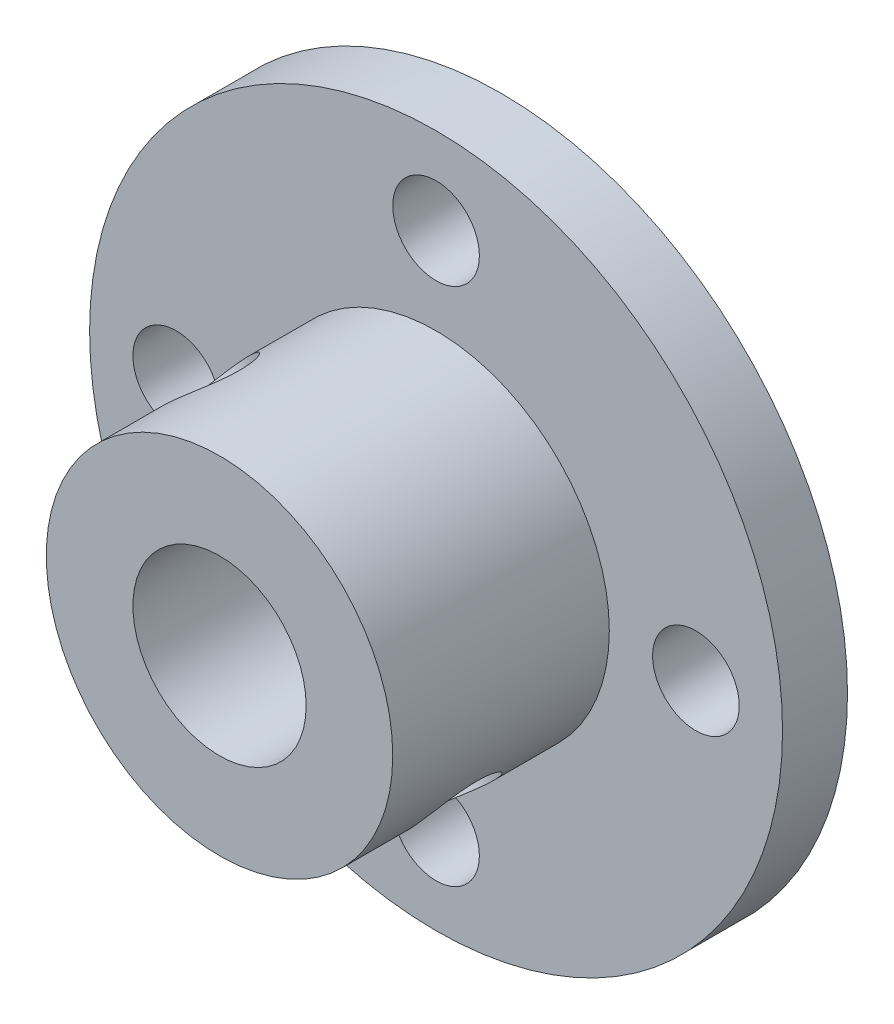
ISO-10303-21;
HEADER;
FILE_DESCRIPTION(('STEP AP214'),'2;1');
FILE_NAME('part.step','',(''),(''),'','','');
FILE_SCHEMA(('AUTOMOTIVE_DESIGN { 1 0 10303 214 1 1 1 1 }'));
ENDSEC;
DATA;
#1=APPLICATION_CONTEXT('core data for automotive mechanical design processes');
#2=APPLICATION_PROTOCOL_DEFINITION('international standard','automotive_design',2000,#1);
#3=PRODUCT_CONTEXT('',#1,'mechanical');
#4=PRODUCT('Part','Part','',(#3));
#5=PRODUCT_RELATED_PRODUCT_CATEGORY('part','',(#4));
#6=PRODUCT_DEFINITION_FORMATION('','',#4);
#7=PRODUCT_DEFINITION_CONTEXT('part definition',#1,'design');
#8=PRODUCT_DEFINITION('design','',#6,#7);
#9=PRODUCT_DEFINITION_SHAPE('','',#8);
#10=(LENGTH_UNIT() NAMED_UNIT(*) SI_UNIT(.MILLI.,.METRE.));
#11=(NAMED_UNIT(*) PLANE_ANGLE_UNIT() SI_UNIT($,.RADIAN.));
#12=(NAMED_UNIT(*) SI_UNIT($,.STERADIAN.) SOLID_ANGLE_UNIT());
#13=UNCERTAINTY_MEASURE_WITH_UNIT(LENGTH_MEASURE(1.E-05),#10,'distance_accuracy_value','');
#14=(GEOMETRIC_REPRESENTATION_CONTEXT(3) GLOBAL_UNCERTAINTY_ASSIGNED_CONTEXT((#13)) GLOBAL_UNIT_ASSIGNED_CONTEXT((#10,
#11,#12)) REPRESENTATION_CONTEXT('',''));
#15=CARTESIAN_POINT('',(0.,0.,0.));
#16=DIRECTION('',(0.,0.,1.));
#17=DIRECTION('',(1.,0.,0.));
#18=AXIS2_PLACEMENT_3D('',#15,#16,#17);
#19=CARTESIAN_POINT('',(-16.0009999999999,16.0010000000001,8.));
#20=DIRECTION('',(0.707106781186544,-0.707106781186551,0.));
#21=DIRECTION('',(0.707106781186551,0.707106781186544,0.));
#22=AXIS2_PLACEMENT_3D('',#19,#20,#21);
#23=CYLINDRICAL_SURFACE('',#22,2.);
#24=CARTESIAN_POINT('',(-1.03527618041007,3.86370330515628,8.));
#25=CARTESIAN_POINT('',(-1.03528937115707,3.86370459881445,8.10421320547435));
#26=CARTESIAN_POINT('',(-1.04445095043976,3.86128100934838,8.2085621765338));
#27=CARTESIAN_POINT('',(-1.08031794598722,3.8513940803619,8.4140551772306));
#28=CARTESIAN_POINT('',(-1.10706022667328,3.84392015002067,8.51519200324776));
#29=CARTESIAN_POINT('',(-1.1757681040263,3.82345847525807,8.71090315644694));
#30=CARTESIAN_POINT('',(-1.21765273191301,3.81049999591904,8.80550925884925));
#31=CARTESIAN_POINT('',(-1.31402940114759,3.77834613351914,8.98684845047615));
#32=CARTESIAN_POINT('',(-1.36852212452516,3.75915041303458,9.07358111343678));
#33=CARTESIAN_POINT('',(-1.49242262258693,3.71179474047927,9.24461144313339));
#34=CARTESIAN_POINT('',(-1.56268986729788,3.68302601797016,9.32811826759177));
#35=CARTESIAN_POINT('',(-1.71185746004074,3.61610679381541,9.4828167805706));
#36=CARTESIAN_POINT('',(-1.79076208249941,3.57795163529629,9.55400232620397));
#37=CARTESIAN_POINT('',(-1.95971138096947,3.48844672204307,9.6867343011885));
#38=CARTESIAN_POINT('',(-2.0501484554851,3.43638092272624,9.74730753542331));
#39=CARTESIAN_POINT('',(-2.23353894528089,3.32009909967183,9.85028170678709));
#40=CARTESIAN_POINT('',(-2.32649073298613,3.25589078089576,9.8926941123508));
#41=CARTESIAN_POINT('',(-2.50423233896789,3.12095657273505,9.95500932253118));
#42=CARTESIAN_POINT('',(-2.58913230708545,3.05101952081115,9.9762990526921));
#43=CARTESIAN_POINT('',(-2.75418828042582,2.90288047261231,10.000332237369));
#44=CARTESIAN_POINT('',(-2.83434712692782,2.82468350628805,10.0030869135963));
#45=CARTESIAN_POINT('',(-2.98040182849613,2.66974853723374,9.99050665205486));
#46=CARTESIAN_POINT('',(-3.04693182899991,2.59347500057567,9.97672396895637));
#47=CARTESIAN_POINT('',(-3.1721605338748,2.43871042756158,9.93423831219188));
#48=CARTESIAN_POINT('',(-3.23085865182078,2.36021922568683,9.90553422204788));
#49=CARTESIAN_POINT('',(-3.34040810707924,2.20250531142359,9.83383486782005));
#50=CARTESIAN_POINT('',(-3.39113964482628,2.12328750299558,9.79064737365578));
#51=CARTESIAN_POINT('',(-3.48370759115981,1.96773626752488,9.6914731675971));
#52=CARTESIAN_POINT('',(-3.52554080478517,1.89140388456177,9.63548187339533));
#53=CARTESIAN_POINT('',(-3.60428958213897,1.73703649261153,9.50620929693394));
#54=CARTESIAN_POINT('',(-3.64036649555481,1.65952260135774,9.43179394334797));
#55=CARTESIAN_POINT('',(-3.70332720013195,1.51382940179716,9.27082055013965));
#56=CARTESIAN_POINT('',(-3.73020393016801,1.44565728724412,9.18425325545188));
#57=CARTESIAN_POINT('',(-3.77728932408924,1.31795685047572,8.99470361515182));
#58=CARTESIAN_POINT('',(-3.79696615323055,1.25925236275471,8.89102795389158));
#59=CARTESIAN_POINT('',(-3.82838022178833,1.16027085528415,8.674124657282));
#60=CARTESIAN_POINT('',(-3.84012575033585,1.11997461107768,8.56090713396488));
#61=CARTESIAN_POINT('',(-3.85603227368293,1.06386498780706,8.33757097743442));
#62=CARTESIAN_POINT('',(-3.8607205491991,1.04636450399109,8.2279177619129));
#63=CARTESIAN_POINT('',(-3.86461594335437,1.03189824566565,8.00719731696691));
#64=CARTESIAN_POINT('',(-3.86382693378152,1.03491796578463,7.8961311417604));
#65=CARTESIAN_POINT('',(-3.85709694959109,1.0596805772454,7.68869216284256));
#66=CARTESIAN_POINT('',(-3.85172899517204,1.07933918703679,7.59204109778422));
#67=CARTESIAN_POINT('',(-3.83624732829455,1.13313003382101,7.40326442745801));
#68=CARTESIAN_POINT('',(-3.8261320788553,1.16726695795747,7.31114029850652));
#69=CARTESIAN_POINT('',(-3.80000571468504,1.24976121811307,7.12917733819489));
#70=CARTESIAN_POINT('',(-3.7837432298891,1.29870394849985,7.03964196629395));
#71=CARTESIAN_POINT('',(-3.74462291896735,1.40753017427797,6.86906145692096));
#72=CARTESIAN_POINT('',(-3.72176170262139,1.46741928775997,6.78802071296949));
#73=CARTESIAN_POINT('',(-3.66524154585662,1.60377873262911,6.62604246495734));
#74=CARTESIAN_POINT('',(-3.63058476054876,1.681387579446,6.54640569858222));
#75=CARTESIAN_POINT('',(-3.55073224013689,1.84404659815513,6.40117552399527));
#76=CARTESIAN_POINT('',(-3.50553295582569,1.92909927002596,6.33558685947316));
#77=CARTESIAN_POINT('',(-3.40252567713479,2.10559182003167,6.21885254816729));
#78=CARTESIAN_POINT('',(-3.34441639819569,2.19714102664405,6.16813376383323));
#79=CARTESIAN_POINT('',(-3.21642497959978,2.38056150742934,6.08572419203039));
#80=CARTESIAN_POINT('',(-3.14655324686926,2.47243242721348,6.0540166963159));
#81=CARTESIAN_POINT('',(-3.0033013691683,2.64414859154454,6.01326287251486));
#82=CARTESIAN_POINT('',(-2.93083135085753,2.72432380326585,6.00240425133573));
#83=CARTESIAN_POINT('',(-2.77934729282197,2.87869858365824,5.99831346600433));
#84=CARTESIAN_POINT('',(-2.70033555329971,2.95290023480645,6.00507513147114));
#85=CARTESIAN_POINT('',(-2.54388975347635,3.08846943561532,6.03483282431641));
#86=CARTESIAN_POINT('',(-2.46669480823199,3.15036049200077,6.05672973730905));
#87=CARTESIAN_POINT('',(-2.31149669440087,3.26593797100565,6.11465395980667));
#88=CARTESIAN_POINT('',(-2.23349341147185,3.31962321548964,6.15068329570691));
#89=CARTESIAN_POINT('',(-2.07583342321289,3.42053391102494,6.23745425499141));
#90=CARTESIAN_POINT('',(-1.99624869216628,3.46738486763521,6.28875921975186));
#91=CARTESIAN_POINT('',(-1.84145699969247,3.55201788731207,6.4039152881181));
#92=CARTESIAN_POINT('',(-1.76625206959519,3.58979576730869,6.46777215410157));
#93=CARTESIAN_POINT('',(-1.61555786947551,3.66026791477987,6.61359663555942));
#94=CARTESIAN_POINT('',(-1.5407851518637,3.692082097764,6.69673418080029));
#95=CARTESIAN_POINT('',(-1.40285481283076,3.74666670664265,6.87489222830609));
#96=CARTESIAN_POINT('',(-1.33970747877437,3.76942914306031,6.96992313136052));
#97=CARTESIAN_POINT('',(-1.22691845246328,3.80767032151754,7.17330889413025));
#98=CARTESIAN_POINT('',(-1.17776662816841,3.82289615256723,7.28198991073528));
#99=CARTESIAN_POINT('',(-1.1193520755234,3.84024140403409,7.45057811963095));
#100=CARTESIAN_POINT('',(-1.10244115407726,3.84510564702045,7.50764782059068));
#101=CARTESIAN_POINT('',(-1.07408098437127,3.8531247587118,7.62323255750019));
#102=CARTESIAN_POINT('',(-1.06262791767174,3.85628082270829,7.68174655275425));
#103=CARTESIAN_POINT('',(-1.04783389616823,3.86032188599498,7.78360078924729));
#104=CARTESIAN_POINT('',(-1.04313310007069,3.86159132004936,7.82673305725008));
#105=CARTESIAN_POINT('',(-1.03685139155018,3.86328178867123,7.9132356930929));
#106=CARTESIAN_POINT('',(-1.03527068784066,3.86370276648267,7.9566060766667));
#107=CARTESIAN_POINT('',(-1.03527618041007,3.86370330515628,8.));
#108=B_SPLINE_CURVE_WITH_KNOTS('',3,(#24,#25,#26,#27,#28,#29,#30,#31,#32,#33,#34,#35,#36,#37,
#38,#39,#40,#41,#42,#43,#44,#45,#46,#47,#48,#49,#50,#51,#52,#53,#54,#55,#56,#57,#58,#59,#60,#61,
#62,#63,#64,#65,#66,#67,#68,#69,#70,#71,#72,#73,#74,#75,#76,#77,#78,#79,#80,#81,#82,#83,#84,#85,
#86,#87,#88,#89,#90,#91,#92,#93,#94,#95,#96,#97,#98,#99,#100,#101,#102,#103,#104,#105,#106,
#107),.UNSPECIFIED.,.T.,.F.,(4,2,2,2,2,2,2,2,2,2,2,2,2,2,2,2,2,2,2,2,2,2,2,2,2,2,2,2,2,2,2,2,2,
2,2,2,2,2,2,2,2,4),(0.,0.312464245189432,0.62558578564961,0.937057191861536,1.24854545093096,
1.58572462503713,1.92307142172808,2.28315784481594,2.64301653931849,2.97726969939937,
3.31132047376147,3.61632194973143,3.92134625038977,4.2305906946636,4.5399459870461,
4.87854382917848,5.21740096495904,5.57777683462964,5.93777548427477,6.2692458171249,
6.60048186380813,6.89548366852118,7.19058104876193,7.49934592816242,7.80826972444162,
8.15613487165293,8.50411729960471,8.86128362829998,9.2181355962161,9.5422454078304,
9.8662417359201,10.1688884974705,10.4715786702809,10.7872150144301,11.1029966020551,
11.450204837042,11.7977188569438,12.1562149808128,12.3351395323571,12.5139387197526,
12.6440387634036,12.7741475095882),.UNSPECIFIED.);
#109=CARTESIAN_POINT('',(-1.03527618041007,3.86370330515628,8.));
#110=VERTEX_POINT('',#109);
#111=EDGE_CURVE('E42',#110,#110,#108,.T.);
#112=ORIENTED_EDGE('',*,*,#111,.T.);
#113=EDGE_LOOP('',(#112));
#114=FACE_BOUND('',#113,.T.);
#115=CARTESIAN_POINT('',(-4.06301201267853,6.89143913742478,8.));
#116=CARTESIAN_POINT('',(-4.06301572174605,6.89143840992681,7.88955939925874));
#117=CARTESIAN_POINT('',(-4.07119094661862,6.88663699998201,7.77908408105719));
#118=CARTESIAN_POINT('',(-4.10347952386447,6.86744467364213,7.56130593746119));
#119=CARTESIAN_POINT('',(-4.12760215209937,6.85304817619187,7.45400499642545));
#120=CARTESIAN_POINT('',(-4.19053882294763,6.81474355280742,7.24575716945026));
#121=CARTESIAN_POINT('',(-4.22933389862519,6.79084770456589,7.14480227569144));
#122=CARTESIAN_POINT('',(-4.3198345608916,6.73363818775691,6.9517513179681));
#123=CARTESIAN_POINT('',(-4.37154069559709,6.70032411934728,6.85965563033583));
#124=CARTESIAN_POINT('',(-4.48684637018169,6.62367602880001,6.68491068379023));
#125=CARTESIAN_POINT('',(-4.55066154225097,6.58015630647199,6.60248511971996));
#126=CARTESIAN_POINT('',(-4.68695643232213,6.48377932397727,6.45139088451173));
#127=CARTESIAN_POINT('',(-4.7594369593601,6.43092119171464,6.3827234995026));
#128=CARTESIAN_POINT('',(-4.91142734598455,6.31562284697672,6.26017962589498));
#129=CARTESIAN_POINT('',(-4.99102117674818,6.25305922347525,6.20652288947083));
#130=CARTESIAN_POINT('',(-5.15341964034347,6.11990810519381,6.11695228467754));
#131=CARTESIAN_POINT('',(-5.23622379749711,6.04932179617393,6.08103579846759));
#132=CARTESIAN_POINT('',(-5.40042272750259,5.90315727405418,6.02868173233713));
#133=CARTESIAN_POINT('',(-5.48181206953385,5.8277091562918,6.01186428453874));
#134=CARTESIAN_POINT('',(-5.6422070256904,5.67256036974155,5.99699329657956));
#135=CARTESIAN_POINT('',(-5.72121299050977,5.59286033141333,5.99893698223232));
#136=CARTESIAN_POINT('',(-5.87281120401382,5.43340869422122,6.02125988020012));
#137=CARTESIAN_POINT('',(-5.94550686942914,5.35369748174389,6.04122906004309));
#138=CARTESIAN_POINT('',(-6.08465610567806,5.19500759492311,6.0983770160388));
#139=CARTESIAN_POINT('',(-6.15110934400261,5.11602895980284,6.13555670830193));
#140=CARTESIAN_POINT('',(-6.2770671423308,4.96069819810764,6.22640205654965));
#141=CARTESIAN_POINT('',(-6.33650349248262,4.88437625109207,6.2802136357294));
#142=CARTESIAN_POINT('',(-6.44688377889622,4.73773421784555,6.40268454329301));
#143=CARTESIAN_POINT('',(-6.4978262349365,4.66741517877451,6.4713464548485));
#144=CARTESIAN_POINT('',(-6.59197311379384,4.53351729227361,6.6237669935859));
#145=CARTESIAN_POINT('',(-6.63493079405376,4.47017237442473,6.70788391387822));
#146=CARTESIAN_POINT('',(-6.71106072843317,4.35504775238665,6.8876799788322));
#147=CARTESIAN_POINT('',(-6.74423252520296,4.30326858875806,6.9833596635928));
#148=CARTESIAN_POINT('',(-6.80076933823169,4.21335778070841,7.18423202731917));
#149=CARTESIAN_POINT('',(-6.82408602244806,4.17529352918697,7.28946858425056));
#150=CARTESIAN_POINT('',(-6.86057652149192,4.11506298248306,7.50606837446116));
#151=CARTESIAN_POINT('',(-6.87375250685298,4.09289328527097,7.61743029118651));
#152=CARTESIAN_POINT('',(-6.88969956057791,4.06599066107954,7.8399676012185));
#153=CARTESIAN_POINT('',(-6.89273625372942,4.06081265687824,7.9510702346637));
#154=CARTESIAN_POINT('',(-6.88913796294822,4.06691415530251,8.17265754926253));
#155=CARTESIAN_POINT('',(-6.88250386932812,4.07819214295555,8.28314228636099));
#156=CARTESIAN_POINT('',(-6.85978220326757,4.11629222019201,8.49849141196377));
#157=CARTESIAN_POINT('',(-6.84385108021398,4.14285696526503,8.60341818125668));
#158=CARTESIAN_POINT('',(-6.80272093796121,4.21005104125886,8.80674516628135));
#159=CARTESIAN_POINT('',(-6.7775208208831,4.25068203824297,8.90514460724427));
#160=CARTESIAN_POINT('',(-6.71736283956602,4.3451376269405,9.09475302229388));
#161=CARTESIAN_POINT('',(-6.68222325351205,4.39920540384646,9.18578307203449));
#162=CARTESIAN_POINT('',(-6.60257934082746,4.51785801571833,9.35615069024109));
#163=CARTESIAN_POINT('',(-6.55807347503844,4.58244457883882,9.43548633332006));
#164=CARTESIAN_POINT('',(-6.45878734955345,4.72139000779991,9.58224883405677));
#165=CARTESIAN_POINT('',(-6.40377787521784,4.79595295356261,9.64932805003905));
#166=CARTESIAN_POINT('',(-6.28489454123501,4.95071787868591,9.767148693561));
#167=CARTESIAN_POINT('',(-6.22102114420665,5.03091956364617,9.81789097328657));
#168=CARTESIAN_POINT('',(-6.08598132443733,5.19344794722504,9.90115682762235));
#169=CARTESIAN_POINT('',(-6.01487188961836,5.27575472095152,9.93381142750326));
#170=CARTESIAN_POINT('',(-5.8665692993935,5.44018458825885,9.98036826768673));
#171=CARTESIAN_POINT('',(-5.78937732112474,5.52230771423234,9.99427412699123));
#172=CARTESIAN_POINT('',(-5.63317772311656,5.68149723269523,10.0027351791511));
#173=CARTESIAN_POINT('',(-5.55427562898411,5.75864031304158,9.99780341819082));
#174=CARTESIAN_POINT('',(-5.3950712532528,5.90805599965965,9.9699043454113));
#175=CARTESIAN_POINT('',(-5.3147690133653,5.98032875071102,9.94693756997366));
#176=CARTESIAN_POINT('',(-5.15577475692783,6.11792374119857,9.88389556045828));
#177=CARTESIAN_POINT('',(-5.07707639915268,6.18328130338115,9.84391309337124));
#178=CARTESIAN_POINT('',(-4.92343720739467,6.30630346196863,9.74805884196086));
#179=CARTESIAN_POINT('',(-4.84849684848015,6.3639670872652,9.69218505465903));
#180=CARTESIAN_POINT('',(-4.70320842178739,6.47211220000849,9.56456953200773));
#181=CARTESIAN_POINT('',(-4.63301338394888,6.52238852804646,9.49247971419234));
#182=CARTESIAN_POINT('',(-4.50185397028254,6.6136001453671,9.33515429604531));
#183=CARTESIAN_POINT('',(-4.44089193901815,6.65453306338501,9.24991536777767));
#184=CARTESIAN_POINT('',(-4.32963282694851,6.72746593795128,9.06679717162108));
#185=CARTESIAN_POINT('',(-4.27955592822712,6.75928499530024,8.96871175326949));
#186=CARTESIAN_POINT('',(-4.19386822084574,6.8127849706802,8.76388902025036));
#187=CARTESIAN_POINT('',(-4.15824688832146,6.83447326579852,8.65715806781231));
#188=CARTESIAN_POINT('',(-4.10842695365119,6.86451006442524,8.45884597632968));
#189=CARTESIAN_POINT('',(-4.09145200755024,6.87460498183151,8.36821367122773));
#190=CARTESIAN_POINT('',(-4.06874346251729,6.88806953629403,8.18506226200462));
#191=CARTESIAN_POINT('',(-4.06300890467823,6.89143974702919,8.0925433195112));
#192=CARTESIAN_POINT('',(-4.06301201267853,6.89143913742478,8.));
#193=B_SPLINE_CURVE_WITH_KNOTS('',3,(#115,#116,#117,#118,#119,#120,#121,#122,#123,#124,#125,
#126,#127,#128,#129,#130,#131,#132,#133,#134,#135,#136,#137,#138,#139,#140,#141,#142,#143,#144,
#145,#146,#147,#148,#149,#150,#151,#152,#153,#154,#155,#156,#157,#158,#159,#160,#161,#162,#163,
#164,#165,#166,#167,#168,#169,#170,#171,#172,#173,#174,#175,#176,#177,#178,#179,#180,#181,#182,
#183,#184,#185,#186,#187,#188,#189,#190,#191,#192),.UNSPECIFIED.,.T.,.F.,(4,2,2,2,2,2,2,2,2,2,2,
2,2,2,2,2,2,2,2,2,2,2,2,2,2,2,2,2,2,2,2,2,2,2,2,2,2,2,4),(0.,0.330981953388908,
0.662156593142933,0.992904581732817,1.32366661404383,1.66099163354381,1.99834817183893,
2.34041197118336,2.68242527877674,3.01751000796277,3.35254518932816,3.68014610151158,
4.00776445379829,4.33834299403556,4.66897908375131,5.00856373257529,5.34816424959842,
5.68941145606722,6.03058560103638,6.36274859809374,6.69488101747042,7.02157924007366,
7.34831617137135,7.68146276687326,8.01466415108036,8.35620264772256,8.69772332575643,
9.03673658245544,9.37568439127231,9.70546756901966,10.0352409390159,10.3632390124777,
10.6912784459046,11.0271767726566,11.3631602525241,11.7054118182895,12.0474137709606,
12.3247826174462,12.6021278008238),.UNSPECIFIED.);
#194=CARTESIAN_POINT('',(-4.06301201267853,6.89143913742478,8.));
#195=VERTEX_POINT('',#194);
#196=EDGE_CURVE('E87',#195,#195,#193,.T.);
#197=ORIENTED_EDGE('',*,*,#196,.T.);
#198=EDGE_LOOP('',(#197));
#199=FACE_BOUND('',#198,.T.);
#200=ADVANCED_FACE('F38',(#114,#199),#23,.F.);
#201=CARTESIAN_POINT('',(0.,0.,3.));
#202=DIRECTION('',(0.,0.,-1.));
#203=DIRECTION('',(-1.,0.,0.));
#204=AXIS2_PLACEMENT_3D('',#201,#202,#203);
#205=CYLINDRICAL_SURFACE('',#204,16.);
#206=CARTESIAN_POINT('',(0.,0.,3.));
#207=DIRECTION('',(0.,0.,1.));
#208=DIRECTION('',(1.,0.,0.));
#209=AXIS2_PLACEMENT_3D('',#206,#207,#208);
#210=CIRCLE('',#209,16.);
#211=CARTESIAN_POINT('',(16.,0.,3.));
#212=VERTEX_POINT('',#211);
#213=EDGE_CURVE('E51',#212,#212,#210,.T.);
#214=ORIENTED_EDGE('',*,*,#213,.F.);
#215=EDGE_LOOP('',(#214));
#216=FACE_BOUND('',#215,.T.);
#217=CARTESIAN_POINT('',(0.,0.,0.));
#218=DIRECTION('',(0.,0.,1.));
#219=DIRECTION('',(1.,0.,0.));
#220=AXIS2_PLACEMENT_3D('',#217,#218,#219);
#221=CIRCLE('',#220,16.);
#222=CARTESIAN_POINT('',(16.,0.,0.));
#223=VERTEX_POINT('',#222);
#224=EDGE_CURVE('E56',#223,#223,#221,.T.);
#225=ORIENTED_EDGE('',*,*,#224,.T.);
#226=EDGE_LOOP('',(#225));
#227=FACE_BOUND('',#226,.T.);
#228=ADVANCED_FACE('F40',(#216,#227),#205,.T.);
#229=CARTESIAN_POINT('',(0.,0.,3.));
#230=DIRECTION('',(0.,0.,1.));
#231=DIRECTION('',(1.,0.,0.));
#232=AXIS2_PLACEMENT_3D('',#229,#230,#231);
#233=PLANE('',#232);
#234=CARTESIAN_POINT('',(0.,12.,3.));
#235=DIRECTION('',(0.,0.,1.));
#236=DIRECTION('',(1.,0.,0.));
#237=AXIS2_PLACEMENT_3D('',#234,#235,#236);
#238=CIRCLE('',#237,2.);
#239=CARTESIAN_POINT('',(2.,12.,3.));
#240=VERTEX_POINT('',#239);
#241=EDGE_CURVE('E94',#240,#240,#238,.T.);
#242=ORIENTED_EDGE('',*,*,#241,.F.);
#243=EDGE_LOOP('',(#242));
#244=FACE_BOUND('',#243,.T.);
#245=CARTESIAN_POINT('',(12.,0.,3.));
#246=DIRECTION('',(0.,0.,1.));
#247=DIRECTION('',(1.,0.,0.));
#248=AXIS2_PLACEMENT_3D('',#245,#246,#247);
#249=CIRCLE('',#248,2.);
#250=CARTESIAN_POINT('',(14.,0.,3.));
#251=VERTEX_POINT('',#250);
#252=EDGE_CURVE('E98',#251,#251,#249,.T.);
#253=ORIENTED_EDGE('',*,*,#252,.F.);
#254=EDGE_LOOP('',(#253));
#255=FACE_BOUND('',#254,.T.);
#256=CARTESIAN_POINT('',(0.,-12.,3.));
#257=DIRECTION('',(0.,0.,1.));
#258=DIRECTION('',(1.,0.,0.));
#259=AXIS2_PLACEMENT_3D('',#256,#257,#258);
#260=CIRCLE('',#259,2.);
#261=CARTESIAN_POINT('',(2.,-12.,3.));
#262=VERTEX_POINT('',#261);
#263=EDGE_CURVE('E104',#262,#262,#260,.T.);
#264=ORIENTED_EDGE('',*,*,#263,.F.);
#265=EDGE_LOOP('',(#264));
#266=FACE_BOUND('',#265,.T.);
#267=CARTESIAN_POINT('',(-12.,0.,3.));
#268=DIRECTION('',(0.,0.,1.));
#269=DIRECTION('',(1.,0.,0.));
#270=AXIS2_PLACEMENT_3D('',#267,#268,#269);
#271=CIRCLE('',#270,2.);
#272=CARTESIAN_POINT('',(-10.,0.,3.));
#273=VERTEX_POINT('',#272);
#274=EDGE_CURVE('E110',#273,#273,#271,.T.);
#275=ORIENTED_EDGE('',*,*,#274,.F.);
#276=EDGE_LOOP('',(#275));
#277=FACE_BOUND('',#276,.T.);
#278=CARTESIAN_POINT('',(0.,0.,3.));
#279=DIRECTION('',(0.,0.,1.));
#280=DIRECTION('',(1.,0.,0.));
#281=AXIS2_PLACEMENT_3D('',#278,#279,#280);
#282=CIRCLE('',#281,8.);
#283=CARTESIAN_POINT('',(8.,0.,3.));
#284=VERTEX_POINT('',#283);
#285=EDGE_CURVE('E10',#284,#284,#282,.T.);
#286=ORIENTED_EDGE('',*,*,#285,.F.);
#287=EDGE_LOOP('',(#286));
#288=FACE_BOUND('',#287,.T.);
#289=ORIENTED_EDGE('',*,*,#213,.T.);
#290=EDGE_LOOP('',(#289));
#291=FACE_BOUND('',#290,.T.);
#292=ADVANCED_FACE('F120',(#244,#255,#266,#277,#288,#291),#233,.T.);
#293=CARTESIAN_POINT('',(0.,0.,0.));
#294=DIRECTION('',(0.,0.,1.));
#295=DIRECTION('',(1.,0.,0.));
#296=AXIS2_PLACEMENT_3D('',#293,#294,#295);
#297=PLANE('',#296);
#298=CARTESIAN_POINT('',(0.,0.,0.));
#299=DIRECTION('',(0.,0.,1.));
#300=DIRECTION('',(1.,0.,0.));
#301=AXIS2_PLACEMENT_3D('',#298,#299,#300);
#302=CIRCLE('',#301,4.);
#303=CARTESIAN_POINT('',(4.,0.,0.));
#304=VERTEX_POINT('',#303);
#305=EDGE_CURVE('E68',#304,#304,#302,.F.);
#306=ORIENTED_EDGE('',*,*,#305,.F.);
#307=EDGE_LOOP('',(#306));
#308=FACE_BOUND('',#307,.T.);
#309=CARTESIAN_POINT('',(0.,12.,0.));
#310=DIRECTION('',(0.,0.,1.));
#311=DIRECTION('',(1.,0.,0.));
#312=AXIS2_PLACEMENT_3D('',#309,#310,#311);
#313=CIRCLE('',#312,2.);
#314=CARTESIAN_POINT('',(2.,12.,0.));
#315=VERTEX_POINT('',#314);
#316=EDGE_CURVE('E97',#315,#315,#313,.F.);
#317=ORIENTED_EDGE('',*,*,#316,.F.);
#318=EDGE_LOOP('',(#317));
#319=FACE_BOUND('',#318,.T.);
#320=CARTESIAN_POINT('',(12.,0.,0.));
#321=DIRECTION('',(0.,0.,1.));
#322=DIRECTION('',(1.,0.,0.));
#323=AXIS2_PLACEMENT_3D('',#320,#321,#322);
#324=CIRCLE('',#323,2.);
#325=CARTESIAN_POINT('',(14.,0.,0.));
#326=VERTEX_POINT('',#325);
#327=EDGE_CURVE('E101',#326,#326,#324,.F.);
#328=ORIENTED_EDGE('',*,*,#327,.F.);
#329=EDGE_LOOP('',(#328));
#330=FACE_BOUND('',#329,.T.);
#331=CARTESIAN_POINT('',(0.,-12.,0.));
#332=DIRECTION('',(0.,0.,1.));
#333=DIRECTION('',(1.,0.,0.));
#334=AXIS2_PLACEMENT_3D('',#331,#332,#333);
#335=CIRCLE('',#334,2.);
#336=CARTESIAN_POINT('',(2.,-12.,0.));
#337=VERTEX_POINT('',#336);
#338=EDGE_CURVE('E107',#337,#337,#335,.F.);
#339=ORIENTED_EDGE('',*,*,#338,.F.);
#340=EDGE_LOOP('',(#339));
#341=FACE_BOUND('',#340,.T.);
#342=CARTESIAN_POINT('',(-12.,0.,0.));
#343=DIRECTION('',(0.,0.,1.));
#344=DIRECTION('',(1.,0.,0.));
#345=AXIS2_PLACEMENT_3D('',#342,#343,#344);
#346=CIRCLE('',#345,2.);
#347=CARTESIAN_POINT('',(-10.,0.,0.));
#348=VERTEX_POINT('',#347);
#349=EDGE_CURVE('E93',#348,#348,#346,.F.);
#350=ORIENTED_EDGE('',*,*,#349,.F.);
#351=EDGE_LOOP('',(#350));
#352=FACE_BOUND('',#351,.T.);
#353=ORIENTED_EDGE('',*,*,#224,.F.);
#354=EDGE_LOOP('',(#353));
#355=FACE_BOUND('',#354,.T.);
#356=ADVANCED_FACE('F123',(#308,#319,#330,#341,#352,#355),#297,.F.);
#357=CARTESIAN_POINT('',(0.,0.,13.));
#358=DIRECTION('',(0.,0.,-1.));
#359=DIRECTION('',(-1.,0.,0.));
#360=AXIS2_PLACEMENT_3D('',#357,#358,#359);
#361=CYLINDRICAL_SURFACE('',#360,8.);
#362=ORIENTED_EDGE('',*,*,#196,.F.);
#363=EDGE_LOOP('',(#362));
#364=FACE_BOUND('',#363,.T.);
#365=CARTESIAN_POINT('',(6.89143913742473,-4.06301201267861,8.));
#366=CARTESIAN_POINT('',(6.89143840992676,-4.06301572174612,8.11044060074126));
#367=CARTESIAN_POINT('',(6.88663699998197,-4.07119094661869,8.22091591894282));
#368=CARTESIAN_POINT('',(6.86744467364209,-4.10347952386455,8.43869406253881));
#369=CARTESIAN_POINT('',(6.85304817619183,-4.12760215209945,8.54599500357455));
#370=CARTESIAN_POINT('',(6.81474355280737,-4.1905388229477,8.75424283054975));
#371=CARTESIAN_POINT('',(6.79084770456585,-4.22933389862526,8.85519772430857));
#372=CARTESIAN_POINT('',(6.73363818775686,-4.31983456089166,9.04824868203191));
#373=CARTESIAN_POINT('',(6.70032411934724,-4.37154069559716,9.14034436966418));
#374=CARTESIAN_POINT('',(6.62367602879996,-4.48684637018177,9.31508931620977));
#375=CARTESIAN_POINT('',(6.58015630647194,-4.55066154225104,9.39751488028004));
#376=CARTESIAN_POINT('',(6.48377932397722,-4.6869564323222,9.54860911548827));
#377=CARTESIAN_POINT('',(6.43092119171458,-4.75943695936017,9.6172765004974));
#378=CARTESIAN_POINT('',(6.31562284697667,-4.91142734598462,9.73982037410502));
#379=CARTESIAN_POINT('',(6.2530592234752,-4.99102117674825,9.79347711052917));
#380=CARTESIAN_POINT('',(6.11990810519375,-5.15341964034354,9.88304771532247));
#381=CARTESIAN_POINT('',(6.04932179617387,-5.23622379749717,9.91896420153241));
#382=CARTESIAN_POINT('',(5.90315727405412,-5.40042272750266,9.97131826766287));
#383=CARTESIAN_POINT('',(5.82770915629174,-5.48181206953391,9.98813571546127));
#384=CARTESIAN_POINT('',(5.67256036974149,-5.64220702569046,10.0030067034204));
#385=CARTESIAN_POINT('',(5.59286033141327,-5.72121299050983,10.0010630177677));
#386=CARTESIAN_POINT('',(5.43340869422116,-5.87281120401388,9.97874011979989));
#387=CARTESIAN_POINT('',(5.35369748174383,-5.94550686942919,9.95877093995692));
#388=CARTESIAN_POINT('',(5.19500759492305,-6.08465610567811,9.9016229839612));
#389=CARTESIAN_POINT('',(5.11602895980277,-6.15110934400267,9.86444329169807));
#390=CARTESIAN_POINT('',(4.96069819810757,-6.27706714233085,9.77359794345035));
#391=CARTESIAN_POINT('',(4.884376251092,-6.33650349248267,9.7197863642706));
#392=CARTESIAN_POINT('',(4.73773421784548,-6.44688377889626,9.597315456707));
#393=CARTESIAN_POINT('',(4.66741517877444,-6.49782623493655,9.52865354515151));
#394=CARTESIAN_POINT('',(4.53351729227354,-6.59197311379388,9.3762330064141));
#395=CARTESIAN_POINT('',(4.47017237442466,-6.6349307940538,9.29211608612179));
#396=CARTESIAN_POINT('',(4.35504775238658,-6.71106072843322,9.1123200211678));
#397=CARTESIAN_POINT('',(4.30326858875799,-6.744232525203,9.0166403364072));
#398=CARTESIAN_POINT('',(4.21335778070834,-6.80076933823173,8.81576797268083));
#399=CARTESIAN_POINT('',(4.17529352918689,-6.82408602244811,8.71053141574945));
#400=CARTESIAN_POINT('',(4.11506298248299,-6.86057652149197,8.49393162553884));
#401=CARTESIAN_POINT('',(4.0928932852709,-6.87375250685302,8.38256970881349));
#402=CARTESIAN_POINT('',(4.06599066107947,-6.88969956057796,8.1600323987815));
#403=CARTESIAN_POINT('',(4.06081265687817,-6.89273625372946,8.0489297653363));
#404=CARTESIAN_POINT('',(4.06691415530243,-6.88913796294826,7.82734245073748));
#405=CARTESIAN_POINT('',(4.07819214295548,-6.88250386932817,7.71685771363901));
#406=CARTESIAN_POINT('',(4.11629222019194,-6.85978220326761,7.50150858803624));
#407=CARTESIAN_POINT('',(4.14285696526496,-6.84385108021402,7.39658181874333));
#408=CARTESIAN_POINT('',(4.21005104125879,-6.80272093796125,7.19325483371866));
#409=CARTESIAN_POINT('',(4.2506820382429,-6.77752082088315,7.09485539275573));
#410=CARTESIAN_POINT('',(4.34513762694043,-6.71736283956607,6.90524697770612));
#411=CARTESIAN_POINT('',(4.39920540384639,-6.68222325351209,6.81421692796552));
#412=CARTESIAN_POINT('',(4.51785801571826,-6.60257934082751,6.64384930975892));
#413=CARTESIAN_POINT('',(4.58244457883875,-6.55807347503849,6.56451366667994));
#414=CARTESIAN_POINT('',(4.72139000779984,-6.4587873495535,6.41775116594324));
#415=CARTESIAN_POINT('',(4.79595295356254,-6.40377787521789,6.35067194996095));
#416=CARTESIAN_POINT('',(4.95071787868584,-6.28489454123507,6.23285130643901));
#417=CARTESIAN_POINT('',(5.03091956364611,-6.22102114420671,6.18210902671344));
#418=CARTESIAN_POINT('',(5.19344794722498,-6.08598132443739,6.09884317237765));
#419=CARTESIAN_POINT('',(5.27575472095146,-6.01487188961842,6.06618857249675));
#420=CARTESIAN_POINT('',(5.44018458825879,-5.86656929939356,6.01963173231327));
#421=CARTESIAN_POINT('',(5.52230771423228,-5.7893773211248,6.00572587300877));
#422=CARTESIAN_POINT('',(5.68149723269517,-5.63317772311662,5.99726482084892));
#423=CARTESIAN_POINT('',(5.75864031304152,-5.55427562898417,6.00219658180919));
#424=CARTESIAN_POINT('',(5.90805599965959,-5.39507125325287,6.0300956545887));
#425=CARTESIAN_POINT('',(5.98032875071096,-5.31476901336536,6.05306243002634));
#426=CARTESIAN_POINT('',(6.11792374119852,-5.1557747569279,6.11610443954172));
#427=CARTESIAN_POINT('',(6.18328130338109,-5.07707639915275,6.15608690662876));
#428=CARTESIAN_POINT('',(6.30630346196858,-4.92343720739474,6.25194115803915));
#429=CARTESIAN_POINT('',(6.36396708726515,-4.84849684848022,6.30781494534097));
#430=CARTESIAN_POINT('',(6.47211220000844,-4.70320842178746,6.43543046799226));
#431=CARTESIAN_POINT('',(6.52238852804641,-4.63301338394895,6.50752028580766));
#432=CARTESIAN_POINT('',(6.61360014536706,-4.50185397028262,6.6648457039547));
#433=CARTESIAN_POINT('',(6.65453306338496,-4.44089193901822,6.75008463222233));
#434=CARTESIAN_POINT('',(6.72746593795124,-4.32963282694858,6.93320282837892));
#435=CARTESIAN_POINT('',(6.7592849953002,-4.27955592822719,7.03128824673051));
#436=CARTESIAN_POINT('',(6.81278497068016,-4.19386822084581,7.23611097974964));
#437=CARTESIAN_POINT('',(6.83447326579848,-4.15824688832153,7.34284193218769));
#438=CARTESIAN_POINT('',(6.86451006442519,-4.10842695365126,7.54115402367032));
#439=CARTESIAN_POINT('',(6.87460498183146,-4.09145200755031,7.63178632877228));
#440=CARTESIAN_POINT('',(6.88806953629398,-4.06874346251736,7.81493773799538));
#441=CARTESIAN_POINT('',(6.89143974702914,-4.0630089046783,7.90745668048881));
#442=CARTESIAN_POINT('',(6.89143913742473,-4.06301201267861,8.));
#443=B_SPLINE_CURVE_WITH_KNOTS('',3,(#365,#366,#367,#368,#369,#370,#371,#372,#373,#374,#375,
#376,#377,#378,#379,#380,#381,#382,#383,#384,#385,#386,#387,#388,#389,#390,#391,#392,#393,#394,
#395,#396,#397,#398,#399,#400,#401,#402,#403,#404,#405,#406,#407,#408,#409,#410,#411,#412,#413,
#414,#415,#416,#417,#418,#419,#420,#421,#422,#423,#424,#425,#426,#427,#428,#429,#430,#431,#432,
#433,#434,#435,#436,#437,#438,#439,#440,#441,#442),.UNSPECIFIED.,.T.,.F.,(4,2,2,2,2,2,2,2,2,2,2,
2,2,2,2,2,2,2,2,2,2,2,2,2,2,2,2,2,2,2,2,2,2,2,2,2,2,2,4),(0.,0.33098195338891,0.662156593142933,
0.992904581732815,1.32366661404383,1.66099163354381,1.99834817183893,2.34041197118336,
2.68242527877674,3.01751000796277,3.35254518932816,3.68014610151158,4.00776445379829,
4.33834299403556,4.66897908375131,5.00856373257529,5.34816424959841,5.68941145606722,
6.03058560103638,6.36274859809374,6.69488101747042,7.02157924007366,7.34831617137134,
7.68146276687326,8.01466415108036,8.35620264772255,8.69772332575643,9.03673658245543,
9.37568439127231,9.70546756901965,10.0352409390158,10.3632390124777,10.6912784459046,
11.0271767726566,11.3631602525241,11.7054118182895,12.0474137709606,12.3247826174462,
12.6021278008238),.UNSPECIFIED.);
#444=CARTESIAN_POINT('',(6.89143913742473,-4.06301201267861,8.));
#445=VERTEX_POINT('',#444);
#446=EDGE_CURVE('E81',#445,#445,#443,.T.);
#447=ORIENTED_EDGE('',*,*,#446,.F.);
#448=EDGE_LOOP('',(#447));
#449=FACE_BOUND('',#448,.T.);
#450=CARTESIAN_POINT('',(0.,0.,13.));
#451=DIRECTION('',(0.,0.,1.));
#452=DIRECTION('',(1.,0.,0.));
#453=AXIS2_PLACEMENT_3D('',#450,#451,#452);
#454=CIRCLE('',#453,8.);
#455=CARTESIAN_POINT('',(8.,0.,13.));
#456=VERTEX_POINT('',#455);
#457=EDGE_CURVE('E59',#456,#456,#454,.T.);
#458=ORIENTED_EDGE('',*,*,#457,.F.);
#459=EDGE_LOOP('',(#458));
#460=FACE_BOUND('',#459,.T.);
#461=ORIENTED_EDGE('',*,*,#285,.T.);
#462=EDGE_LOOP('',(#461));
#463=FACE_BOUND('',#462,.T.);
#464=ADVANCED_FACE('F134',(#364,#449,#460,#463),#361,.T.);
#465=CARTESIAN_POINT('',(0.,0.,13.));
#466=DIRECTION('',(0.,0.,1.));
#467=DIRECTION('',(1.,0.,0.));
#468=AXIS2_PLACEMENT_3D('',#465,#466,#467);
#469=PLANE('',#468);
#470=CARTESIAN_POINT('',(0.,0.,13.));
#471=DIRECTION('',(0.,0.,1.));
#472=DIRECTION('',(1.,0.,0.));
#473=AXIS2_PLACEMENT_3D('',#470,#471,#472);
#474=CIRCLE('',#473,4.);
#475=CARTESIAN_POINT('',(4.,0.,13.));
#476=VERTEX_POINT('',#475);
#477=EDGE_CURVE('E261',#476,#476,#474,.T.);
#478=ORIENTED_EDGE('',*,*,#477,.F.);
#479=EDGE_LOOP('',(#478));
#480=FACE_BOUND('',#479,.T.);
#481=ORIENTED_EDGE('',*,*,#457,.T.);
#482=EDGE_LOOP('',(#481));
#483=FACE_BOUND('',#482,.T.);
#484=ADVANCED_FACE('F141',(#480,#483),#469,.T.);
#485=CARTESIAN_POINT('',(-12.,0.,-0.00100000000000013));
#486=DIRECTION('',(0.,0.,1.));
#487=DIRECTION('',(1.,0.,0.));
#488=AXIS2_PLACEMENT_3D('',#485,#486,#487);
#489=CYLINDRICAL_SURFACE('',#488,2.);
#490=ORIENTED_EDGE('',*,*,#274,.T.);
#491=EDGE_LOOP('',(#490));
#492=FACE_BOUND('',#491,.T.);
#493=ORIENTED_EDGE('',*,*,#349,.T.);
#494=EDGE_LOOP('',(#493));
#495=FACE_BOUND('',#494,.T.);
#496=ADVANCED_FACE('F117',(#492,#495),#489,.F.);
#497=CARTESIAN_POINT('',(0.,-12.,-0.00100000000000013));
#498=DIRECTION('',(0.,0.,1.));
#499=DIRECTION('',(1.,0.,0.));
#500=AXIS2_PLACEMENT_3D('',#497,#498,#499);
#501=CYLINDRICAL_SURFACE('',#500,2.);
#502=ORIENTED_EDGE('',*,*,#263,.T.);
#503=EDGE_LOOP('',(#502));
#504=FACE_BOUND('',#503,.T.);
#505=ORIENTED_EDGE('',*,*,#338,.T.);
#506=EDGE_LOOP('',(#505));
#507=FACE_BOUND('',#506,.T.);
#508=ADVANCED_FACE('F175',(#504,#507),#501,.F.);
#509=CARTESIAN_POINT('',(12.,0.,-0.00100000000000013));
#510=DIRECTION('',(0.,0.,1.));
#511=DIRECTION('',(1.,0.,0.));
#512=AXIS2_PLACEMENT_3D('',#509,#510,#511);
#513=CYLINDRICAL_SURFACE('',#512,2.);
#514=ORIENTED_EDGE('',*,*,#252,.T.);
#515=EDGE_LOOP('',(#514));
#516=FACE_BOUND('',#515,.T.);
#517=ORIENTED_EDGE('',*,*,#327,.T.);
#518=EDGE_LOOP('',(#517));
#519=FACE_BOUND('',#518,.T.);
#520=ADVANCED_FACE('F157',(#516,#519),#513,.F.);
#521=CARTESIAN_POINT('',(0.,12.,-0.00100000000000013));
#522=DIRECTION('',(0.,0.,1.));
#523=DIRECTION('',(1.,0.,0.));
#524=AXIS2_PLACEMENT_3D('',#521,#522,#523);
#525=CYLINDRICAL_SURFACE('',#524,2.);
#526=ORIENTED_EDGE('',*,*,#241,.T.);
#527=EDGE_LOOP('',(#526));
#528=FACE_BOUND('',#527,.T.);
#529=ORIENTED_EDGE('',*,*,#316,.T.);
#530=EDGE_LOOP('',(#529));
#531=FACE_BOUND('',#530,.T.);
#532=ADVANCED_FACE('F152',(#528,#531),#525,.F.);
#533=CARTESIAN_POINT('',(3.86370330515627,-1.03527618041011,8.));
#534=CARTESIAN_POINT('',(3.86370459881444,-1.03528937115711,7.89578679452566));
#535=CARTESIAN_POINT('',(3.86128100934837,-1.04445095043981,7.7914378234662));
#536=CARTESIAN_POINT('',(3.85139408036189,-1.08031794598726,7.5859448227694));
#537=CARTESIAN_POINT('',(3.84392015002066,-1.10706022667332,7.48480799675224));
#538=CARTESIAN_POINT('',(3.82345847525806,-1.17576810402634,7.28909684355307));
#539=CARTESIAN_POINT('',(3.81049999591903,-1.21765273191305,7.19449074115075));
#540=CARTESIAN_POINT('',(3.77834613351913,-1.31402940114763,7.01315154952385));
#541=CARTESIAN_POINT('',(3.75915041303457,-1.3685221245252,6.92641888656323));
#542=CARTESIAN_POINT('',(3.71179474047925,-1.49242262258697,6.75538855686662));
#543=CARTESIAN_POINT('',(3.68302601797014,-1.56268986729792,6.67188173240823));
#544=CARTESIAN_POINT('',(3.61610679381539,-1.71185746004078,6.5171832194294));
#545=CARTESIAN_POINT('',(3.57795163529627,-1.79076208249945,6.44599767379603));
#546=CARTESIAN_POINT('',(3.48844672204305,-1.95971138096951,6.3132656988115));
#547=CARTESIAN_POINT('',(3.43638092272622,-2.05014845548513,6.25269246457669));
#548=CARTESIAN_POINT('',(3.3200990996718,-2.23353894528093,6.14971829321291));
#549=CARTESIAN_POINT('',(3.25589078089573,-2.32649073298616,6.1073058876492));
#550=CARTESIAN_POINT('',(3.12095657273502,-2.50423233896793,6.04499067746883));
#551=CARTESIAN_POINT('',(3.05101952081113,-2.58913230708549,6.0237009473079));
#552=CARTESIAN_POINT('',(2.90288047261228,-2.75418828042585,5.99966776263097));
#553=CARTESIAN_POINT('',(2.82468350628803,-2.83434712692785,5.99691308640372));
#554=CARTESIAN_POINT('',(2.66974853723371,-2.98040182849616,6.00949334794514));
#555=CARTESIAN_POINT('',(2.59347500057564,-3.04693182899993,6.02327603104364));
#556=CARTESIAN_POINT('',(2.43871042756155,-3.17216053387483,6.06576168780813));
#557=CARTESIAN_POINT('',(2.36021922568679,-3.2308586518208,6.09446577795213));
#558=CARTESIAN_POINT('',(2.20250531142355,-3.34040810707926,6.16616513217995));
#559=CARTESIAN_POINT('',(2.12328750299554,-3.39113964482631,6.20935262634422));
#560=CARTESIAN_POINT('',(1.96773626752485,-3.48370759115983,6.3085268324029));
#561=CARTESIAN_POINT('',(1.89140388456173,-3.52554080478519,6.36451812660468));
#562=CARTESIAN_POINT('',(1.73703649261149,-3.60428958213899,6.49379070306606));
#563=CARTESIAN_POINT('',(1.65952260135771,-3.64036649555482,6.56820605665203));
#564=CARTESIAN_POINT('',(1.51382940179712,-3.70332720013196,6.72917944986035));
#565=CARTESIAN_POINT('',(1.44565728724409,-3.73020393016803,6.81574674454812));
#566=CARTESIAN_POINT('',(1.31795685047568,-3.77728932408926,7.00529638484818));
#567=CARTESIAN_POINT('',(1.25925236275467,-3.79696615323057,7.10897204610842));
#568=CARTESIAN_POINT('',(1.16027085528411,-3.82838022178834,7.325875342718));
#569=CARTESIAN_POINT('',(1.11997461107764,-3.84012575033586,7.43909286603513));
#570=CARTESIAN_POINT('',(1.06386498780702,-3.85603227368294,7.66242902256558));
#571=CARTESIAN_POINT('',(1.04636450399105,-3.86072054919911,7.7720822380871));
#572=CARTESIAN_POINT('',(1.0318982456656,-3.86461594335438,7.99280268303309));
#573=CARTESIAN_POINT('',(1.03491796578459,-3.86382693378153,8.1038688582396));
#574=CARTESIAN_POINT('',(1.05968057724536,-3.85709694959111,8.31130783715744));
#575=CARTESIAN_POINT('',(1.07933918703675,-3.85172899517206,8.40795890221579));
#576=CARTESIAN_POINT('',(1.13313003382097,-3.83624732829456,8.59673557254199));
#577=CARTESIAN_POINT('',(1.16726695795743,-3.82613207885532,8.68885970149348));
#578=CARTESIAN_POINT('',(1.24976121811303,-3.80000571468506,8.87082266180512));
#579=CARTESIAN_POINT('',(1.29870394849981,-3.78374322988912,8.96035803370605));
#580=CARTESIAN_POINT('',(1.40753017427793,-3.74462291896736,9.13093854307905));
#581=CARTESIAN_POINT('',(1.46741928775993,-3.72176170262141,9.21197928703051));
#582=CARTESIAN_POINT('',(1.60377873262908,-3.66524154585664,9.37395753504266));
#583=CARTESIAN_POINT('',(1.68138757944596,-3.63058476054877,9.45359430141778));
#584=CARTESIAN_POINT('',(1.84404659815509,-3.55073224013691,9.59882447600473));
#585=CARTESIAN_POINT('',(1.92909927002592,-3.50553295582571,9.66441314052684));
#586=CARTESIAN_POINT('',(2.10559182003164,-3.40252567713481,9.78114745183271));
#587=CARTESIAN_POINT('',(2.19714102664402,-3.34441639819571,9.83186623616677));
#588=CARTESIAN_POINT('',(2.38056150742931,-3.2164249795998,9.91427580796962));
#589=CARTESIAN_POINT('',(2.47243242721345,-3.14655324686929,9.9459833036841));
#590=CARTESIAN_POINT('',(2.6441485915445,-3.00330136916832,9.98673712748514));
#591=CARTESIAN_POINT('',(2.72432380326582,-2.93083135085756,9.99759574866428));
#592=CARTESIAN_POINT('',(2.87869858365821,-2.779347292822,10.0016865339957));
#593=CARTESIAN_POINT('',(2.95290023480642,-2.70033555329974,9.99492486852887));
#594=CARTESIAN_POINT('',(3.08846943561529,-2.54388975347639,9.9651671756836));
#595=CARTESIAN_POINT('',(3.15036049200074,-2.46669480823203,9.94327026269095));
#596=CARTESIAN_POINT('',(3.26593797100562,-2.3114966944009,9.88534604019334));
#597=CARTESIAN_POINT('',(3.31962321548961,-2.23349341147189,9.84931670429309));
#598=CARTESIAN_POINT('',(3.42053391102492,-2.07583342321293,9.7625457450086));
#599=CARTESIAN_POINT('',(3.46738486763518,-1.99624869216632,9.71124078024814));
#600=CARTESIAN_POINT('',(3.55201788731205,-1.84145699969251,9.59608471188191));
#601=CARTESIAN_POINT('',(3.58979576730867,-1.76625206959523,9.53222784589844));
#602=CARTESIAN_POINT('',(3.66026791477985,-1.61555786947555,9.38640336444059));
#603=CARTESIAN_POINT('',(3.69208209776398,-1.54078515186374,9.30326581919972));
#604=CARTESIAN_POINT('',(3.74666670664264,-1.4028548128308,9.12510777169391));
#605=CARTESIAN_POINT('',(3.7694291430603,-1.33970747877441,9.03007686863949));
#606=CARTESIAN_POINT('',(3.80767032151753,-1.22691845246332,8.82669110586976));
#607=CARTESIAN_POINT('',(3.82289615256721,-1.17776662816845,8.71801008926473));
#608=CARTESIAN_POINT('',(3.84024140403408,-1.11935207552344,8.54942188036906));
#609=CARTESIAN_POINT('',(3.84510564702043,-1.1024411540773,8.49235217940932));
#610=CARTESIAN_POINT('',(3.85312475871179,-1.07408098437132,8.37676744249981));
#611=CARTESIAN_POINT('',(3.85628082270828,-1.06262791767178,8.31825344724575));
#612=CARTESIAN_POINT('',(3.86032188599497,-1.04783389616827,8.21639921075271));
#613=CARTESIAN_POINT('',(3.86159132004935,-1.04313310007074,8.17326694274993));
#614=CARTESIAN_POINT('',(3.86328178867121,-1.03685139155022,8.0867643069071));
#615=CARTESIAN_POINT('',(3.86370276648266,-1.0352706878407,8.0433939233333));
#616=CARTESIAN_POINT('',(3.86370330515627,-1.03527618041011,8.));
#617=B_SPLINE_CURVE_WITH_KNOTS('',3,(#533,#534,#535,#536,#537,#538,#539,#540,#541,#542,#543,
#544,#545,#546,#547,#548,#549,#550,#551,#552,#553,#554,#555,#556,#557,#558,#559,#560,#561,#562,
#563,#564,#565,#566,#567,#568,#569,#570,#571,#572,#573,#574,#575,#576,#577,#578,#579,#580,#581,
#582,#583,#584,#585,#586,#587,#588,#589,#590,#591,#592,#593,#594,#595,#596,#597,#598,#599,#600,
#601,#602,#603,#604,#605,#606,#607,#608,#609,#610,#611,#612,#613,#614,#615,#616),.UNSPECIFIED.,
.T.,.F.,(4,2,2,2,2,2,2,2,2,2,2,2,2,2,2,2,2,2,2,2,2,2,2,2,2,2,2,2,2,2,2,2,2,2,2,2,2,2,2,2,2,4),
(0.,0.312464245189432,0.62558578564961,0.937057191861536,1.24854545093097,1.58572462503713,
1.92307142172809,2.28315784481594,2.64301653931849,2.97726969939937,3.31132047376147,
3.61632194973143,3.92134625038977,4.2305906946636,4.5399459870461,4.87854382917848,
5.21740096495904,5.57777683462963,5.93777548427477,6.2692458171249,6.60048186380813,
6.89548366852118,7.19058104876193,7.49934592816242,7.80826972444162,8.15613487165293,
8.50411729960472,8.86128362829999,9.2181355962161,9.54224540783041,9.8662417359201,
10.1688884974705,10.4715786702809,10.7872150144301,11.1029966020551,11.450204837042,
11.7977188569438,12.1562149808128,12.3351395323571,12.5139387197526,12.6440387634036,
12.7741475095882),.UNSPECIFIED.);
#618=CARTESIAN_POINT('',(3.86370330515627,-1.03527618041011,8.));
#619=VERTEX_POINT('',#618);
#620=EDGE_CURVE('E63',#619,#619,#617,.T.);
#621=ORIENTED_EDGE('',*,*,#620,.T.);
#622=EDGE_LOOP('',(#621));
#623=FACE_BOUND('',#622,.T.);
#624=ORIENTED_EDGE('',*,*,#446,.T.);
#625=EDGE_LOOP('',(#624));
#626=FACE_BOUND('',#625,.T.);
#627=ADVANCED_FACE('F69',(#623,#626),#23,.F.);
#628=CARTESIAN_POINT('',(0.,0.,-11.3137084989848));
#629=DIRECTION('',(0.,0.,1.));
#630=DIRECTION('',(1.,0.,0.));
#631=AXIS2_PLACEMENT_3D('',#628,#629,#630);
#632=CYLINDRICAL_SURFACE('',#631,4.);
#633=ORIENTED_EDGE('',*,*,#620,.F.);
#634=EDGE_LOOP('',(#633));
#635=FACE_BOUND('',#634,.T.);
#636=ORIENTED_EDGE('',*,*,#305,.T.);
#637=EDGE_LOOP('',(#636));
#638=FACE_BOUND('',#637,.T.);
#639=ORIENTED_EDGE('',*,*,#477,.T.);
#640=EDGE_LOOP('',(#639));
#641=FACE_BOUND('',#640,.T.);
#642=ORIENTED_EDGE('',*,*,#111,.F.);
#643=EDGE_LOOP('',(#642));
#644=FACE_BOUND('',#643,.T.);
#645=ADVANCED_FACE('F73',(#635,#638,#641,#644),#632,.F.);
#646=CLOSED_SHELL('',(#200,#228,#292,#356,#464,#484,#496,#508,#520,#532,#627,#645));
#647=MANIFOLD_SOLID_BREP('B2',#646);
#648=ADVANCED_BREP_SHAPE_REPRESENTATION('',(#18,#647),#14);
#649=SHAPE_DEFINITION_REPRESENTATION(#9,#648);
ENDSEC;
END-ISO-10303-21;
